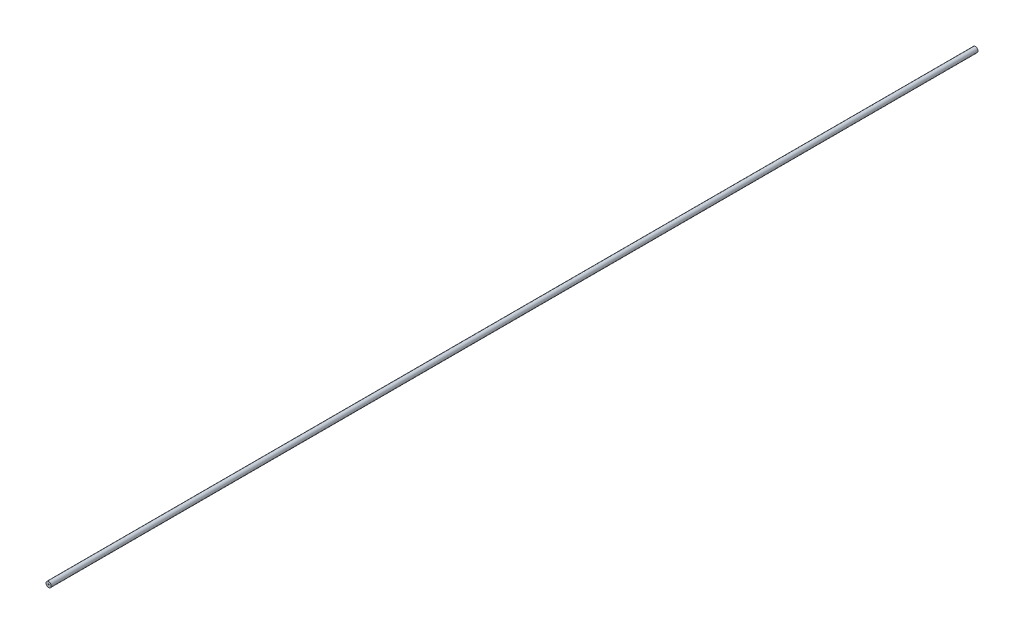
ISO-10303-21;
HEADER;
FILE_DESCRIPTION(('STEP AP214'),'2;1');
FILE_NAME('part.step','',(''),(''),'','','');
FILE_SCHEMA(('AUTOMOTIVE_DESIGN { 1 0 10303 214 1 1 1 1 }'));
ENDSEC;
DATA;
#1=APPLICATION_CONTEXT('core data for automotive mechanical design processes');
#2=APPLICATION_PROTOCOL_DEFINITION('international standard','automotive_design',2000,#1);
#3=PRODUCT_CONTEXT('',#1,'mechanical');
#4=PRODUCT('Part','Part','',(#3));
#5=PRODUCT_RELATED_PRODUCT_CATEGORY('part','',(#4));
#6=PRODUCT_DEFINITION_FORMATION('','',#4);
#7=PRODUCT_DEFINITION_CONTEXT('part definition',#1,'design');
#8=PRODUCT_DEFINITION('design','',#6,#7);
#9=PRODUCT_DEFINITION_SHAPE('','',#8);
#10=(LENGTH_UNIT() NAMED_UNIT(*) SI_UNIT(.MILLI.,.METRE.));
#11=(NAMED_UNIT(*) PLANE_ANGLE_UNIT() SI_UNIT($,.RADIAN.));
#12=(NAMED_UNIT(*) SI_UNIT($,.STERADIAN.) SOLID_ANGLE_UNIT());
#13=UNCERTAINTY_MEASURE_WITH_UNIT(LENGTH_MEASURE(1.E-05),#10,'distance_accuracy_value','');
#14=(GEOMETRIC_REPRESENTATION_CONTEXT(3) GLOBAL_UNCERTAINTY_ASSIGNED_CONTEXT((#13)) GLOBAL_UNIT_ASSIGNED_CONTEXT((#10,
#11,#12)) REPRESENTATION_CONTEXT('',''));
#15=CARTESIAN_POINT('',(0.,0.,0.));
#16=DIRECTION('',(0.,0.,1.));
#17=DIRECTION('',(1.,0.,0.));
#18=AXIS2_PLACEMENT_3D('',#15,#16,#17);
#19=CARTESIAN_POINT('',(0.,0.,488.696070125041));
#20=DIRECTION('',(0.,0.,1.));
#21=DIRECTION('',(1.,0.,0.));
#22=AXIS2_PLACEMENT_3D('',#19,#20,#21);
#23=PLANE('',#22);
#24=CARTESIAN_POINT('',(0.,0.,488.696070125041));
#25=DIRECTION('',(0.,0.,1.));
#26=DIRECTION('',(1.,0.,0.));
#27=AXIS2_PLACEMENT_3D('',#24,#25,#26);
#28=CIRCLE('',#27,2.75);
#29=CARTESIAN_POINT('',(2.75,0.,488.696070125041));
#30=VERTEX_POINT('',#29);
#31=EDGE_CURVE('E10',#30,#30,#28,.T.);
#32=ORIENTED_EDGE('',*,*,#31,.T.);
#33=EDGE_LOOP('',(#32));
#34=FACE_BOUND('',#33,.T.);
#35=CARTESIAN_POINT('',(0.,0.,488.696070125041));
#36=DIRECTION('',(0.,0.,1.));
#37=DIRECTION('',(1.,0.,0.));
#38=AXIS2_PLACEMENT_3D('',#35,#36,#37);
#39=CIRCLE('',#38,0.5);
#40=CARTESIAN_POINT('',(0.5,0.,488.696070125041));
#41=VERTEX_POINT('',#40);
#42=EDGE_CURVE('E44',#41,#41,#39,.T.);
#43=ORIENTED_EDGE('',*,*,#42,.F.);
#44=EDGE_LOOP('',(#43));
#45=FACE_BOUND('',#44,.T.);
#46=ADVANCED_FACE('F33',(#34,#45),#23,.T.);
#47=CARTESIAN_POINT('',(0.,0.,-488.696070125041));
#48=DIRECTION('',(0.,0.,1.));
#49=DIRECTION('',(1.,0.,0.));
#50=AXIS2_PLACEMENT_3D('',#47,#48,#49);
#51=PLANE('',#50);
#52=CARTESIAN_POINT('',(0.,0.,-488.696070125041));
#53=DIRECTION('',(0.,0.,1.));
#54=DIRECTION('',(1.,0.,0.));
#55=AXIS2_PLACEMENT_3D('',#52,#53,#54);
#56=CIRCLE('',#55,2.75);
#57=CARTESIAN_POINT('',(2.75,0.,-488.696070125041));
#58=VERTEX_POINT('',#57);
#59=EDGE_CURVE('E37',#58,#58,#56,.T.);
#60=ORIENTED_EDGE('',*,*,#59,.F.);
#61=EDGE_LOOP('',(#60));
#62=FACE_BOUND('',#61,.T.);
#63=CARTESIAN_POINT('',(0.,0.,-488.696070125041));
#64=DIRECTION('',(0.,0.,1.));
#65=DIRECTION('',(1.,0.,0.));
#66=AXIS2_PLACEMENT_3D('',#63,#64,#65);
#67=CIRCLE('',#66,0.5);
#68=CARTESIAN_POINT('',(0.5,0.,-488.696070125041));
#69=VERTEX_POINT('',#68);
#70=EDGE_CURVE('E46',#69,#69,#67,.T.);
#71=ORIENTED_EDGE('',*,*,#70,.T.);
#72=EDGE_LOOP('',(#71));
#73=FACE_BOUND('',#72,.T.);
#74=ADVANCED_FACE('F56',(#62,#73),#51,.F.);
#75=CARTESIAN_POINT('',(0.,0.,488.696070125041));
#76=DIRECTION('',(0.,0.,-1.));
#77=DIRECTION('',(-1.,0.,0.));
#78=AXIS2_PLACEMENT_3D('',#75,#76,#77);
#79=CYLINDRICAL_SURFACE('',#78,2.75);
#80=ORIENTED_EDGE('',*,*,#31,.F.);
#81=EDGE_LOOP('',(#80));
#82=FACE_BOUND('',#81,.T.);
#83=ORIENTED_EDGE('',*,*,#59,.T.);
#84=EDGE_LOOP('',(#83));
#85=FACE_BOUND('',#84,.T.);
#86=ADVANCED_FACE('F35',(#82,#85),#79,.T.);
#87=CARTESIAN_POINT('',(0.,0.,488.696070125041));
#88=DIRECTION('',(0.,0.,-1.));
#89=DIRECTION('',(-1.,0.,0.));
#90=AXIS2_PLACEMENT_3D('',#87,#88,#89);
#91=CYLINDRICAL_SURFACE('',#90,0.5);
#92=ORIENTED_EDGE('',*,*,#42,.T.);
#93=EDGE_LOOP('',(#92));
#94=FACE_BOUND('',#93,.T.);
#95=ORIENTED_EDGE('',*,*,#70,.F.);
#96=EDGE_LOOP('',(#95));
#97=FACE_BOUND('',#96,.T.);
#98=ADVANCED_FACE('F52',(#94,#97),#91,.F.);
#99=CLOSED_SHELL('',(#46,#74,#86,#98));
#100=MANIFOLD_SOLID_BREP('B2',#99);
#101=ADVANCED_BREP_SHAPE_REPRESENTATION('',(#18,#100),#14);
#102=SHAPE_DEFINITION_REPRESENTATION(#9,#101);
ENDSEC;
END-ISO-10303-21;
